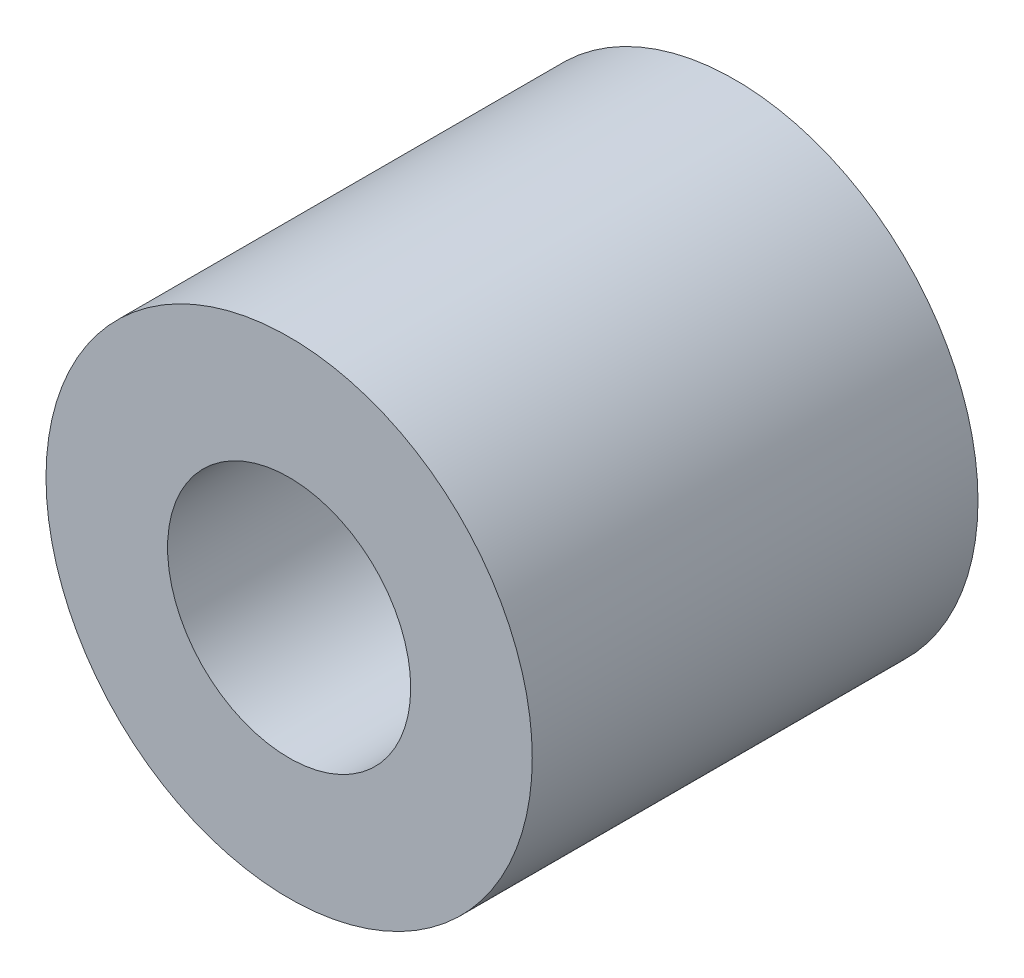
ISO-10303-21;
HEADER;
FILE_DESCRIPTION(('STEP AP214'),'2;1');
FILE_NAME('part.step','',(''),(''),'','','');
FILE_SCHEMA(('AUTOMOTIVE_DESIGN { 1 0 10303 214 1 1 1 1 }'));
ENDSEC;
DATA;
#1=APPLICATION_CONTEXT('core data for automotive mechanical design processes');
#2=APPLICATION_PROTOCOL_DEFINITION('international standard','automotive_design',2000,#1);
#3=PRODUCT_CONTEXT('',#1,'mechanical');
#4=PRODUCT('Part','Part','',(#3));
#5=PRODUCT_RELATED_PRODUCT_CATEGORY('part','',(#4));
#6=PRODUCT_DEFINITION_FORMATION('','',#4);
#7=PRODUCT_DEFINITION_CONTEXT('part definition',#1,'design');
#8=PRODUCT_DEFINITION('design','',#6,#7);
#9=PRODUCT_DEFINITION_SHAPE('','',#8);
#10=(LENGTH_UNIT() NAMED_UNIT(*) SI_UNIT(.MILLI.,.METRE.));
#11=(NAMED_UNIT(*) PLANE_ANGLE_UNIT() SI_UNIT($,.RADIAN.));
#12=(NAMED_UNIT(*) SI_UNIT($,.STERADIAN.) SOLID_ANGLE_UNIT());
#13=UNCERTAINTY_MEASURE_WITH_UNIT(LENGTH_MEASURE(1.E-05),#10,'distance_accuracy_value','');
#14=(GEOMETRIC_REPRESENTATION_CONTEXT(3) GLOBAL_UNCERTAINTY_ASSIGNED_CONTEXT((#13)) GLOBAL_UNIT_ASSIGNED_CONTEXT((#10,
#11,#12)) REPRESENTATION_CONTEXT('',''));
#15=CARTESIAN_POINT('',(0.,0.,0.));
#16=DIRECTION('',(0.,0.,1.));
#17=DIRECTION('',(1.,0.,0.));
#18=AXIS2_PLACEMENT_3D('',#15,#16,#17);
#19=CARTESIAN_POINT('',(0.,0.,5.5));
#20=DIRECTION('',(0.,0.,1.));
#21=DIRECTION('',(1.,0.,0.));
#22=AXIS2_PLACEMENT_3D('',#19,#20,#21);
#23=PLANE('',#22);
#24=CARTESIAN_POINT('',(0.,0.,5.5));
#25=DIRECTION('',(0.,0.,1.));
#26=DIRECTION('',(1.,0.,0.));
#27=AXIS2_PLACEMENT_3D('',#24,#25,#26);
#28=CIRCLE('',#27,3.);
#29=CARTESIAN_POINT('',(3.,0.,5.5));
#30=VERTEX_POINT('',#29);
#31=EDGE_CURVE('E10',#30,#30,#28,.T.);
#32=ORIENTED_EDGE('',*,*,#31,.T.);
#33=EDGE_LOOP('',(#32));
#34=FACE_BOUND('',#33,.T.);
#35=CARTESIAN_POINT('',(0.,0.,5.5));
#36=DIRECTION('',(0.,0.,1.));
#37=DIRECTION('',(1.,0.,0.));
#38=AXIS2_PLACEMENT_3D('',#35,#36,#37);
#39=CIRCLE('',#38,1.5);
#40=CARTESIAN_POINT('',(1.5,0.,5.5));
#41=VERTEX_POINT('',#40);
#42=EDGE_CURVE('E44',#41,#41,#39,.T.);
#43=ORIENTED_EDGE('',*,*,#42,.F.);
#44=EDGE_LOOP('',(#43));
#45=FACE_BOUND('',#44,.T.);
#46=ADVANCED_FACE('F33',(#34,#45),#23,.T.);
#47=CARTESIAN_POINT('',(0.,0.,0.));
#48=DIRECTION('',(0.,0.,1.));
#49=DIRECTION('',(1.,0.,0.));
#50=AXIS2_PLACEMENT_3D('',#47,#48,#49);
#51=PLANE('',#50);
#52=CARTESIAN_POINT('',(0.,0.,0.));
#53=DIRECTION('',(0.,0.,1.));
#54=DIRECTION('',(1.,0.,0.));
#55=AXIS2_PLACEMENT_3D('',#52,#53,#54);
#56=CIRCLE('',#55,3.);
#57=CARTESIAN_POINT('',(3.,0.,0.));
#58=VERTEX_POINT('',#57);
#59=EDGE_CURVE('E37',#58,#58,#56,.T.);
#60=ORIENTED_EDGE('',*,*,#59,.F.);
#61=EDGE_LOOP('',(#60));
#62=FACE_BOUND('',#61,.T.);
#63=CARTESIAN_POINT('',(0.,0.,0.));
#64=DIRECTION('',(0.,0.,1.));
#65=DIRECTION('',(1.,0.,0.));
#66=AXIS2_PLACEMENT_3D('',#63,#64,#65);
#67=CIRCLE('',#66,1.5);
#68=CARTESIAN_POINT('',(1.5,0.,0.));
#69=VERTEX_POINT('',#68);
#70=EDGE_CURVE('E46',#69,#69,#67,.T.);
#71=ORIENTED_EDGE('',*,*,#70,.T.);
#72=EDGE_LOOP('',(#71));
#73=FACE_BOUND('',#72,.T.);
#74=ADVANCED_FACE('F56',(#62,#73),#51,.F.);
#75=CARTESIAN_POINT('',(0.,0.,5.5));
#76=DIRECTION('',(0.,0.,-1.));
#77=DIRECTION('',(-1.,0.,0.));
#78=AXIS2_PLACEMENT_3D('',#75,#76,#77);
#79=CYLINDRICAL_SURFACE('',#78,3.);
#80=ORIENTED_EDGE('',*,*,#31,.F.);
#81=EDGE_LOOP('',(#80));
#82=FACE_BOUND('',#81,.T.);
#83=ORIENTED_EDGE('',*,*,#59,.T.);
#84=EDGE_LOOP('',(#83));
#85=FACE_BOUND('',#84,.T.);
#86=ADVANCED_FACE('F35',(#82,#85),#79,.T.);
#87=CARTESIAN_POINT('',(0.,0.,5.5));
#88=DIRECTION('',(0.,0.,-1.));
#89=DIRECTION('',(-1.,0.,0.));
#90=AXIS2_PLACEMENT_3D('',#87,#88,#89);
#91=CYLINDRICAL_SURFACE('',#90,1.5);
#92=ORIENTED_EDGE('',*,*,#42,.T.);
#93=EDGE_LOOP('',(#92));
#94=FACE_BOUND('',#93,.T.);
#95=ORIENTED_EDGE('',*,*,#70,.F.);
#96=EDGE_LOOP('',(#95));
#97=FACE_BOUND('',#96,.T.);
#98=ADVANCED_FACE('F52',(#94,#97),#91,.F.);
#99=CLOSED_SHELL('',(#46,#74,#86,#98));
#100=MANIFOLD_SOLID_BREP('B2',#99);
#101=ADVANCED_BREP_SHAPE_REPRESENTATION('',(#18,#100),#14);
#102=SHAPE_DEFINITION_REPRESENTATION(#9,#101);
ENDSEC;
END-ISO-10303-21;
